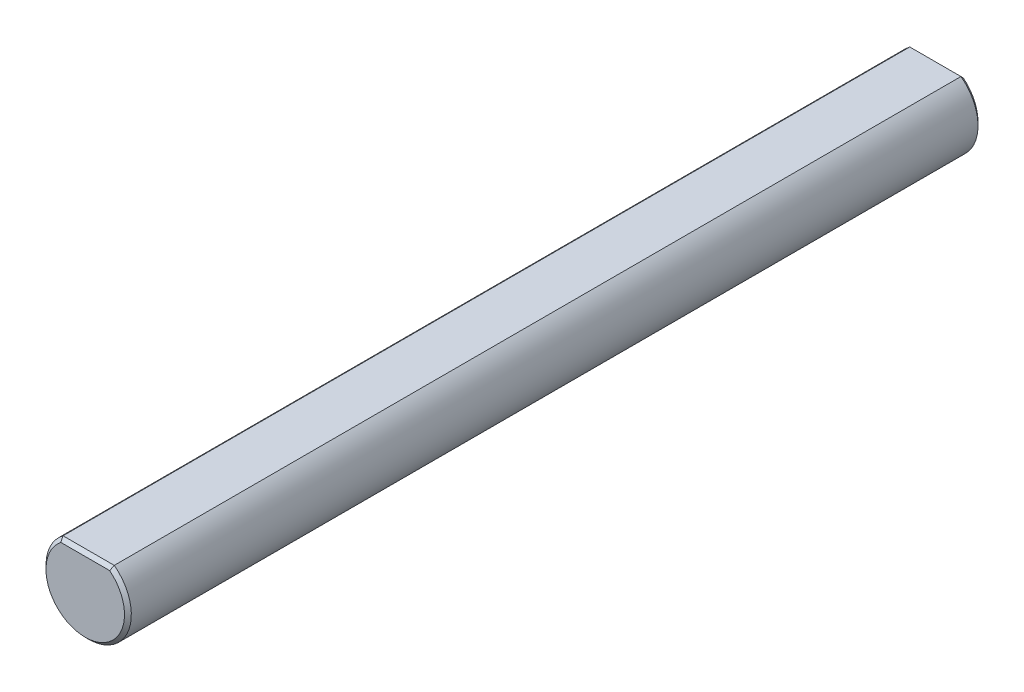
ISO-10303-21;
HEADER;
FILE_DESCRIPTION(('STEP AP214'),'2;1');
FILE_NAME('part.step','',(''),(''),'','','');
FILE_SCHEMA(('AUTOMOTIVE_DESIGN { 1 0 10303 214 1 1 1 1 }'));
ENDSEC;
DATA;
#1=APPLICATION_CONTEXT('core data for automotive mechanical design processes');
#2=APPLICATION_PROTOCOL_DEFINITION('international standard','automotive_design',2000,#1);
#3=PRODUCT_CONTEXT('',#1,'mechanical');
#4=PRODUCT('Part','Part','',(#3));
#5=PRODUCT_RELATED_PRODUCT_CATEGORY('part','',(#4));
#6=PRODUCT_DEFINITION_FORMATION('','',#4);
#7=PRODUCT_DEFINITION_CONTEXT('part definition',#1,'design');
#8=PRODUCT_DEFINITION('design','',#6,#7);
#9=PRODUCT_DEFINITION_SHAPE('','',#8);
#10=(LENGTH_UNIT() NAMED_UNIT(*) SI_UNIT(.MILLI.,.METRE.));
#11=(NAMED_UNIT(*) PLANE_ANGLE_UNIT() SI_UNIT($,.RADIAN.));
#12=(NAMED_UNIT(*) SI_UNIT($,.STERADIAN.) SOLID_ANGLE_UNIT());
#13=UNCERTAINTY_MEASURE_WITH_UNIT(LENGTH_MEASURE(1.E-05),#10,'distance_accuracy_value','');
#14=(GEOMETRIC_REPRESENTATION_CONTEXT(3) GLOBAL_UNCERTAINTY_ASSIGNED_CONTEXT((#13)) GLOBAL_UNIT_ASSIGNED_CONTEXT((#10,
#11,#12)) REPRESENTATION_CONTEXT('',''));
#15=CARTESIAN_POINT('',(0.,0.,0.));
#16=DIRECTION('',(0.,0.,1.));
#17=DIRECTION('',(1.,0.,0.));
#18=AXIS2_PLACEMENT_3D('',#15,#16,#17);
#19=CARTESIAN_POINT('',(0.,0.,25.));
#20=DIRECTION('',(0.,0.,-1.));
#21=DIRECTION('',(-1.,0.,0.));
#22=AXIS2_PLACEMENT_3D('',#19,#20,#21);
#23=CYLINDRICAL_SURFACE('',#22,2.5);
#24=DIRECTION('',(0.,0.,-1.));
#25=VECTOR('',#24,1.);
#26=CARTESIAN_POINT('',(1.5,2.,25.));
#27=LINE('',#26,#25);
#28=CARTESIAN_POINT('',(1.5,2.,24.8));
#29=VERTEX_POINT('',#28);
#30=CARTESIAN_POINT('',(1.5,2.,-24.8));
#31=VERTEX_POINT('',#30);
#32=EDGE_CURVE('E87',#29,#31,#27,.T.);
#33=ORIENTED_EDGE('',*,*,#32,.F.);
#34=CARTESIAN_POINT('',(0.,0.,24.8));
#35=DIRECTION('',(0.,0.,1.));
#36=DIRECTION('',(1.,0.,0.));
#37=AXIS2_PLACEMENT_3D('',#34,#35,#36);
#38=CIRCLE('',#37,2.5);
#39=CARTESIAN_POINT('',(-1.5,2.,24.8));
#40=VERTEX_POINT('',#39);
#41=EDGE_CURVE('E83',#29,#40,#38,.F.);
#42=ORIENTED_EDGE('',*,*,#41,.T.);
#43=DIRECTION('',(0.,0.,-1.));
#44=VECTOR('',#43,1.);
#45=CARTESIAN_POINT('',(-1.5,2.,25.));
#46=LINE('',#45,#44);
#47=CARTESIAN_POINT('',(-1.5,2.,-24.8));
#48=VERTEX_POINT('',#47);
#49=EDGE_CURVE('E85',#40,#48,#46,.T.);
#50=ORIENTED_EDGE('',*,*,#49,.T.);
#51=CARTESIAN_POINT('',(0.,0.,-24.8));
#52=DIRECTION('',(0.,0.,1.));
#53=DIRECTION('',(1.,0.,0.));
#54=AXIS2_PLACEMENT_3D('',#51,#52,#53);
#55=CIRCLE('',#54,2.5);
#56=EDGE_CURVE('E92',#48,#31,#55,.T.);
#57=ORIENTED_EDGE('',*,*,#56,.T.);
#58=EDGE_LOOP('',(#33,#42,#50,#57));
#59=FACE_BOUND('',#58,.T.);
#60=ADVANCED_FACE('F34',(#59),#23,.T.);
#61=CARTESIAN_POINT('',(0.,2.,25.));
#62=DIRECTION('',(0.,1.,0.));
#63=DIRECTION('',(0.,0.,1.));
#64=AXIS2_PLACEMENT_3D('',#61,#62,#63);
#65=PLANE('',#64);
#66=ORIENTED_EDGE('',*,*,#49,.F.);
#67=DIRECTION('',(1.,0.,0.));
#68=VECTOR('',#67,1.);
#69=CARTESIAN_POINT('',(0.,2.,24.8));
#70=LINE('',#69,#68);
#71=EDGE_CURVE('E98',#40,#29,#70,.T.);
#72=ORIENTED_EDGE('',*,*,#71,.T.);
#73=ORIENTED_EDGE('',*,*,#32,.T.);
#74=DIRECTION('',(-1.,0.,0.));
#75=VECTOR('',#74,1.);
#76=CARTESIAN_POINT('',(-1.5,2.,-24.8));
#77=LINE('',#76,#75);
#78=EDGE_CURVE('E99',#31,#48,#77,.T.);
#79=ORIENTED_EDGE('',*,*,#78,.T.);
#80=EDGE_LOOP('',(#66,#72,#73,#79));
#81=FACE_BOUND('',#80,.T.);
#82=ADVANCED_FACE('F96',(#81),#65,.T.);
#83=CARTESIAN_POINT('',(0.,0.,25.));
#84=DIRECTION('',(0.,0.,1.));
#85=DIRECTION('',(1.,0.,0.));
#86=AXIS2_PLACEMENT_3D('',#83,#84,#85);
#87=PLANE('',#86);
#88=CARTESIAN_POINT('',(0.,0.,25.));
#89=DIRECTION('',(0.,0.,1.));
#90=DIRECTION('',(1.,0.,0.));
#91=AXIS2_PLACEMENT_3D('',#88,#89,#90);
#92=CIRCLE('',#91,2.3);
#93=CARTESIAN_POINT('',(-1.43178210632767,1.79999999999997,25.));
#94=VERTEX_POINT('',#93);
#95=CARTESIAN_POINT('',(1.43178210632767,1.79999999999997,25.));
#96=VERTEX_POINT('',#95);
#97=EDGE_CURVE('E104',#94,#96,#92,.T.);
#98=ORIENTED_EDGE('',*,*,#97,.T.);
#99=DIRECTION('',(-1.,0.,0.));
#100=VECTOR('',#99,1.);
#101=CARTESIAN_POINT('',(0.,1.8,25.));
#102=LINE('',#101,#100);
#103=EDGE_CURVE('E112',#96,#94,#102,.T.);
#104=ORIENTED_EDGE('',*,*,#103,.T.);
#105=EDGE_LOOP('',(#98,#104));
#106=FACE_BOUND('',#105,.T.);
#107=ADVANCED_FACE('F147',(#106),#87,.T.);
#108=CARTESIAN_POINT('',(0.,0.,-25.));
#109=DIRECTION('',(0.,0.,1.));
#110=DIRECTION('',(1.,0.,0.));
#111=AXIS2_PLACEMENT_3D('',#108,#109,#110);
#112=PLANE('',#111);
#113=CARTESIAN_POINT('',(0.,0.,-25.));
#114=DIRECTION('',(0.,0.,1.));
#115=DIRECTION('',(1.,0.,0.));
#116=AXIS2_PLACEMENT_3D('',#113,#114,#115);
#117=CIRCLE('',#116,2.3);
#118=CARTESIAN_POINT('',(1.43178210632767,1.79999999999997,-25.));
#119=VERTEX_POINT('',#118);
#120=CARTESIAN_POINT('',(-1.43178210632767,1.79999999999997,-25.));
#121=VERTEX_POINT('',#120);
#122=EDGE_CURVE('E48',#119,#121,#117,.F.);
#123=ORIENTED_EDGE('',*,*,#122,.T.);
#124=DIRECTION('',(1.,0.,0.));
#125=VECTOR('',#124,1.);
#126=CARTESIAN_POINT('',(1.5,1.8,-25.));
#127=LINE('',#126,#125);
#128=EDGE_CURVE('E11',#121,#119,#127,.T.);
#129=ORIENTED_EDGE('',*,*,#128,.T.);
#130=EDGE_LOOP('',(#123,#129));
#131=FACE_BOUND('',#130,.T.);
#132=ADVANCED_FACE('F145',(#131),#112,.F.);
#133=CARTESIAN_POINT('',(0.,0.,25.));
#134=DIRECTION('',(0.,0.,-1.));
#135=DIRECTION('',(-1.,0.,0.));
#136=AXIS2_PLACEMENT_3D('',#133,#134,#135);
#137=CONICAL_SURFACE('',#136,2.3,0.785398163397453);
#138=CARTESIAN_POINT('',(1.5,2.,24.8));
#139=CARTESIAN_POINT('',(1.4888803343446,1.96662404366757,24.8333759563324));
#140=CARTESIAN_POINT('',(1.47763567874643,1.93326940371163,24.8667305962884));
#141=CARTESIAN_POINT('',(1.45489638100215,1.86660273701998,24.93339726298));
#142=CARTESIAN_POINT('',(1.44340173870956,1.83329071030925,24.9667092896907));
#143=CARTESIAN_POINT('',(1.43178210632772,1.8,25.));
#144=B_SPLINE_CURVE_WITH_KNOTS('',3,(#138,#139,#140,#141,#142,#143),.UNSPECIFIED.,.F.,.F.,(4,2,
4),(0.,0.145476996925001,0.290954079097025),.UNSPECIFIED.);
#145=EDGE_CURVE('E108',#96,#29,#144,.F.);
#146=ORIENTED_EDGE('',*,*,#145,.F.);
#147=ORIENTED_EDGE('',*,*,#97,.F.);
#148=CARTESIAN_POINT('',(-1.43178210632769,1.8,25.));
#149=CARTESIAN_POINT('',(-1.44340173870953,1.83329071030926,24.9667092896907));
#150=CARTESIAN_POINT('',(-1.45489638100213,1.86660273701999,24.93339726298));
#151=CARTESIAN_POINT('',(-1.47763567874645,1.93326940371163,24.8667305962884));
#152=CARTESIAN_POINT('',(-1.48888033434465,1.96662404366756,24.8333759563324));
#153=CARTESIAN_POINT('',(-1.5000000000001,1.99999999999998,24.8));
#154=B_SPLINE_CURVE_WITH_KNOTS('',3,(#148,#149,#150,#151,#152,#153),.UNSPECIFIED.,.F.,.F.,(4,2,
4),(0.,0.145477082172023,0.290954079097024),.UNSPECIFIED.);
#155=EDGE_CURVE('E100',#40,#94,#154,.F.);
#156=ORIENTED_EDGE('',*,*,#155,.F.);
#157=ORIENTED_EDGE('',*,*,#41,.F.);
#158=EDGE_LOOP('',(#146,#147,#156,#157));
#159=FACE_BOUND('',#158,.T.);
#160=ADVANCED_FACE('F103',(#159),#137,.T.);
#161=CARTESIAN_POINT('',(0.,2.,24.8));
#162=DIRECTION('',(0.,-0.707106781186544,-0.707106781186551));
#163=DIRECTION('',(1.,0.,0.));
#164=AXIS2_PLACEMENT_3D('',#161,#162,#163);
#165=PLANE('',#164);
#166=ORIENTED_EDGE('',*,*,#155,.T.);
#167=ORIENTED_EDGE('',*,*,#103,.F.);
#168=ORIENTED_EDGE('',*,*,#145,.T.);
#169=ORIENTED_EDGE('',*,*,#71,.F.);
#170=EDGE_LOOP('',(#166,#167,#168,#169));
#171=FACE_BOUND('',#170,.T.);
#172=ADVANCED_FACE('F110',(#171),#165,.F.);
#173=CARTESIAN_POINT('',(0.,0.,-24.8));
#174=DIRECTION('',(0.,0.,1.));
#175=DIRECTION('',(1.,0.,0.));
#176=AXIS2_PLACEMENT_3D('',#173,#174,#175);
#177=CONICAL_SURFACE('',#176,2.5,0.785398163397444);
#178=CARTESIAN_POINT('',(1.43178210632769,1.8,-25.));
#179=CARTESIAN_POINT('',(1.44340173870953,1.83329071030925,-24.9667092896907));
#180=CARTESIAN_POINT('',(1.45489638100213,1.86660273701998,-24.93339726298));
#181=CARTESIAN_POINT('',(1.47763567874645,1.93326940371163,-24.8667305962884));
#182=CARTESIAN_POINT('',(1.48888033434465,1.96662404366756,-24.8333759563324));
#183=CARTESIAN_POINT('',(1.5000000000001,1.99999999999998,-24.8));
#184=B_SPLINE_CURVE_WITH_KNOTS('',3,(#178,#179,#180,#181,#182,#183),.UNSPECIFIED.,.F.,.F.,(4,2,
4),(0.,0.145477082172031,0.290954079097037),.UNSPECIFIED.);
#185=EDGE_CURVE('E61',#31,#119,#184,.F.);
#186=ORIENTED_EDGE('',*,*,#185,.F.);
#187=ORIENTED_EDGE('',*,*,#56,.F.);
#188=CARTESIAN_POINT('',(-1.5,2.,-24.8));
#189=CARTESIAN_POINT('',(-1.4888803343446,1.96662404366757,-24.8333759563324));
#190=CARTESIAN_POINT('',(-1.47763567874643,1.93326940371163,-24.8667305962884));
#191=CARTESIAN_POINT('',(-1.45489638100215,1.86660273701998,-24.93339726298));
#192=CARTESIAN_POINT('',(-1.44340173870956,1.83329071030925,-24.9667092896907));
#193=CARTESIAN_POINT('',(-1.43178210632772,1.79999999999999,-25.));
#194=B_SPLINE_CURVE_WITH_KNOTS('',3,(#188,#189,#190,#191,#192,#193),.UNSPECIFIED.,.F.,.F.,(4,2,
4),(0.,0.145476996925007,0.290954079097037),.UNSPECIFIED.);
#195=EDGE_CURVE('E39',#121,#48,#194,.F.);
#196=ORIENTED_EDGE('',*,*,#195,.F.);
#197=ORIENTED_EDGE('',*,*,#122,.F.);
#198=EDGE_LOOP('',(#186,#187,#196,#197));
#199=FACE_BOUND('',#198,.T.);
#200=ADVANCED_FACE('F134',(#199),#177,.T.);
#201=CARTESIAN_POINT('',(0.,1.8,-25.));
#202=DIRECTION('',(0.,0.707106781186551,-0.707106781186544));
#203=DIRECTION('',(-1.,0.,0.));
#204=AXIS2_PLACEMENT_3D('',#201,#202,#203);
#205=PLANE('',#204);
#206=ORIENTED_EDGE('',*,*,#195,.T.);
#207=ORIENTED_EDGE('',*,*,#78,.F.);
#208=ORIENTED_EDGE('',*,*,#185,.T.);
#209=ORIENTED_EDGE('',*,*,#128,.F.);
#210=EDGE_LOOP('',(#206,#207,#208,#209));
#211=FACE_BOUND('',#210,.T.);
#212=ADVANCED_FACE('F36',(#211),#205,.T.);
#213=CLOSED_SHELL('',(#60,#82,#107,#132,#160,#172,#200,#212));
#214=MANIFOLD_SOLID_BREP('B2',#213);
#215=ADVANCED_BREP_SHAPE_REPRESENTATION('',(#18,#214),#14);
#216=SHAPE_DEFINITION_REPRESENTATION(#9,#215);
ENDSEC;
END-ISO-10303-21;
